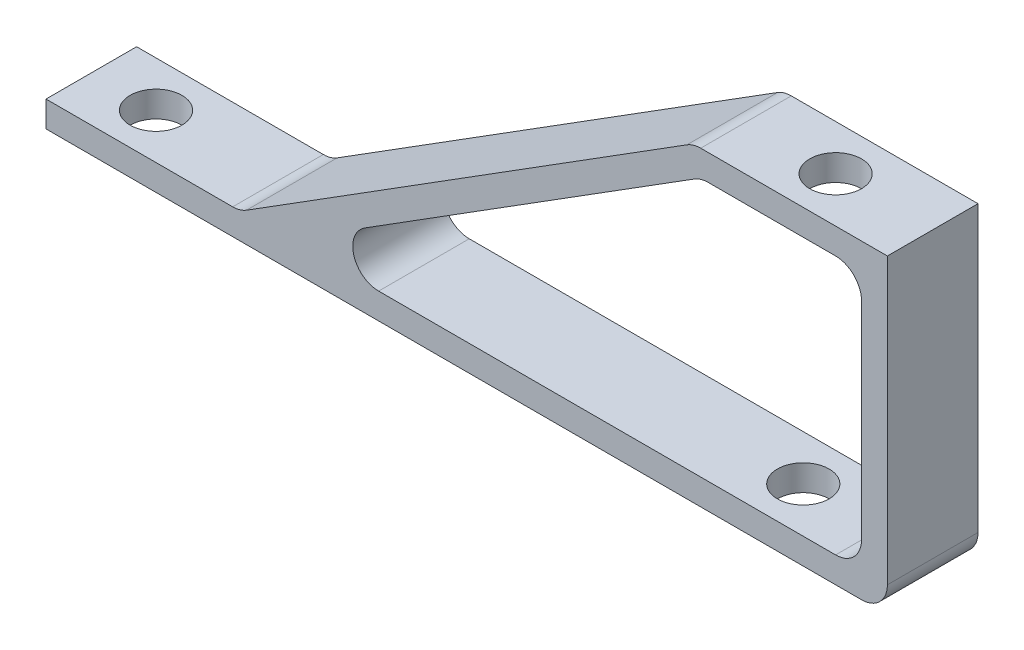
ISO-10303-21;
HEADER;
FILE_DESCRIPTION(('STEP AP214'),'2;1');
FILE_NAME('part.step','',(''),(''),'','','');
FILE_SCHEMA(('AUTOMOTIVE_DESIGN { 1 0 10303 214 1 1 1 1 }'));
ENDSEC;
DATA;
#1=APPLICATION_CONTEXT('core data for automotive mechanical design processes');
#2=APPLICATION_PROTOCOL_DEFINITION('international standard','automotive_design',2000,#1);
#3=PRODUCT_CONTEXT('',#1,'mechanical');
#4=PRODUCT('Part','Part','',(#3));
#5=PRODUCT_RELATED_PRODUCT_CATEGORY('part','',(#4));
#6=PRODUCT_DEFINITION_FORMATION('','',#4);
#7=PRODUCT_DEFINITION_CONTEXT('part definition',#1,'design');
#8=PRODUCT_DEFINITION('design','',#6,#7);
#9=PRODUCT_DEFINITION_SHAPE('','',#8);
#10=(LENGTH_UNIT() NAMED_UNIT(*) SI_UNIT(.MILLI.,.METRE.));
#11=(NAMED_UNIT(*) PLANE_ANGLE_UNIT() SI_UNIT($,.RADIAN.));
#12=(NAMED_UNIT(*) SI_UNIT($,.STERADIAN.) SOLID_ANGLE_UNIT());
#13=UNCERTAINTY_MEASURE_WITH_UNIT(LENGTH_MEASURE(1.E-05),#10,'distance_accuracy_value','');
#14=(GEOMETRIC_REPRESENTATION_CONTEXT(3) GLOBAL_UNCERTAINTY_ASSIGNED_CONTEXT((#13)) GLOBAL_UNIT_ASSIGNED_CONTEXT((#10,
#11,#12)) REPRESENTATION_CONTEXT('',''));
#15=CARTESIAN_POINT('',(0.,0.,0.));
#16=DIRECTION('',(0.,0.,1.));
#17=DIRECTION('',(1.,0.,0.));
#18=AXIS2_PLACEMENT_3D('',#15,#16,#17);
#19=CARTESIAN_POINT('',(0.,2.54,0.));
#20=DIRECTION('',(0.,-1.,0.));
#21=DIRECTION('',(0.,0.,-1.));
#22=AXIS2_PLACEMENT_3D('',#19,#20,#21);
#23=PLANE('',#22);
#24=CARTESIAN_POINT('',(-73.66,2.54,4.445));
#25=DIRECTION('',(0.,1.,0.));
#26=DIRECTION('',(0.,0.,1.));
#27=AXIS2_PLACEMENT_3D('',#24,#25,#26);
#28=CIRCLE('',#27,2.54);
#29=CARTESIAN_POINT('',(-73.66,2.54,6.985));
#30=VERTEX_POINT('',#29);
#31=EDGE_CURVE('E199',#30,#30,#28,.T.);
#32=ORIENTED_EDGE('',*,*,#31,.F.);
#33=EDGE_LOOP('',(#32));
#34=FACE_BOUND('',#33,.T.);
#35=DIRECTION('',(1.,0.,0.));
#36=VECTOR('',#35,1.);
#37=CARTESIAN_POINT('',(0.,2.54,8.89));
#38=LINE('',#37,#36);
#39=CARTESIAN_POINT('',(-80.01,2.54,8.88999999999999));
#40=VERTEX_POINT('',#39);
#41=CARTESIAN_POINT('',(-61.6919879623482,2.54,8.88999999999999));
#42=VERTEX_POINT('',#41);
#43=EDGE_CURVE('E212',#40,#42,#38,.T.);
#44=ORIENTED_EDGE('',*,*,#43,.T.);
#45=DIRECTION('',(0.,0.,1.));
#46=VECTOR('',#45,1.);
#47=CARTESIAN_POINT('',(-61.6919879623482,2.54,0.));
#48=LINE('',#47,#46);
#49=CARTESIAN_POINT('',(-61.6919879623482,2.54,0.));
#50=VERTEX_POINT('',#49);
#51=EDGE_CURVE('E262',#42,#50,#48,.F.);
#52=ORIENTED_EDGE('',*,*,#51,.T.);
#53=DIRECTION('',(-1.,0.,0.));
#54=VECTOR('',#53,1.);
#55=CARTESIAN_POINT('',(0.,2.54,0.));
#56=LINE('',#55,#54);
#57=CARTESIAN_POINT('',(-80.01,2.54,0.));
#58=VERTEX_POINT('',#57);
#59=EDGE_CURVE('E205',#50,#58,#56,.T.);
#60=ORIENTED_EDGE('',*,*,#59,.T.);
#61=DIRECTION('',(0.,0.,1.));
#62=VECTOR('',#61,1.);
#63=CARTESIAN_POINT('',(-80.01,2.54,0.));
#64=LINE('',#63,#62);
#65=EDGE_CURVE('E209',#58,#40,#64,.T.);
#66=ORIENTED_EDGE('',*,*,#65,.T.);
#67=EDGE_LOOP('',(#44,#52,#60,#66));
#68=FACE_BOUND('',#67,.T.);
#69=ADVANCED_FACE('F36',(#34,#68),#23,.F.);
#70=CARTESIAN_POINT('',(-2.54,2.54,0.));
#71=VERTEX_POINT('',#70);
#72=CARTESIAN_POINT('',(-47.3732968025764,2.54,0.));
#73=VERTEX_POINT('',#72);
#74=EDGE_CURVE('E207',#71,#73,#56,.T.);
#75=ORIENTED_EDGE('',*,*,#74,.T.);
#76=DIRECTION('',(0.,0.,1.));
#77=VECTOR('',#76,1.);
#78=CARTESIAN_POINT('',(-47.3732968025764,2.54,0.));
#79=LINE('',#78,#77);
#80=CARTESIAN_POINT('',(-47.3732968025764,2.54,8.88999999999999));
#81=VERTEX_POINT('',#80);
#82=EDGE_CURVE('E239',#73,#81,#79,.T.);
#83=ORIENTED_EDGE('',*,*,#82,.T.);
#84=CARTESIAN_POINT('',(-2.54,2.54,8.89));
#85=VERTEX_POINT('',#84);
#86=EDGE_CURVE('E211',#81,#85,#38,.T.);
#87=ORIENTED_EDGE('',*,*,#86,.T.);
#88=DIRECTION('',(0.,0.,-1.));
#89=VECTOR('',#88,1.);
#90=CARTESIAN_POINT('',(-2.54,2.54,0.));
#91=LINE('',#90,#89);
#92=EDGE_CURVE('E236',#85,#71,#91,.T.);
#93=ORIENTED_EDGE('',*,*,#92,.T.);
#94=EDGE_LOOP('',(#75,#83,#87,#93));
#95=FACE_BOUND('',#94,.T.);
#96=CARTESIAN_POINT('',(-10.16,2.54,4.44499999999999));
#97=DIRECTION('',(0.,1.,0.));
#98=DIRECTION('',(0.,0.,-1.));
#99=AXIS2_PLACEMENT_3D('',#96,#97,#98);
#100=CIRCLE('',#99,2.54);
#101=CARTESIAN_POINT('',(-10.16,2.54,1.905));
#102=VERTEX_POINT('',#101);
#103=EDGE_CURVE('E193',#102,#102,#100,.T.);
#104=ORIENTED_EDGE('',*,*,#103,.F.);
#105=EDGE_LOOP('',(#104));
#106=FACE_BOUND('',#105,.T.);
#107=ADVANCED_FACE('F337',(#95,#106),#23,.F.);
#108=CARTESIAN_POINT('',(0.,0.,0.));
#109=DIRECTION('',(0.,-1.,0.));
#110=DIRECTION('',(0.,0.,-1.));
#111=AXIS2_PLACEMENT_3D('',#108,#109,#110);
#112=PLANE('',#111);
#113=CARTESIAN_POINT('',(-73.66,0.,4.445));
#114=DIRECTION('',(0.,1.,0.));
#115=DIRECTION('',(0.,0.,1.));
#116=AXIS2_PLACEMENT_3D('',#113,#114,#115);
#117=CIRCLE('',#116,2.54);
#118=CARTESIAN_POINT('',(-73.66,0.,6.985));
#119=VERTEX_POINT('',#118);
#120=EDGE_CURVE('E196',#119,#119,#117,.T.);
#121=ORIENTED_EDGE('',*,*,#120,.T.);
#122=EDGE_LOOP('',(#121));
#123=FACE_BOUND('',#122,.T.);
#124=DIRECTION('',(-1.,0.,0.));
#125=VECTOR('',#124,1.);
#126=CARTESIAN_POINT('',(0.,0.,0.));
#127=LINE('',#126,#125);
#128=CARTESIAN_POINT('',(0.,0.,0.));
#129=VERTEX_POINT('',#128);
#130=CARTESIAN_POINT('',(-80.01,0.,0.));
#131=VERTEX_POINT('',#130);
#132=EDGE_CURVE('E202',#129,#131,#127,.T.);
#133=ORIENTED_EDGE('',*,*,#132,.F.);
#134=DIRECTION('',(0.,0.,-1.));
#135=VECTOR('',#134,1.);
#136=CARTESIAN_POINT('',(0.,0.,8.89));
#137=LINE('',#136,#135);
#138=CARTESIAN_POINT('',(0.,0.,8.89));
#139=VERTEX_POINT('',#138);
#140=EDGE_CURVE('E230',#129,#139,#137,.F.);
#141=ORIENTED_EDGE('',*,*,#140,.T.);
#142=DIRECTION('',(1.,0.,0.));
#143=VECTOR('',#142,1.);
#144=CARTESIAN_POINT('',(0.,0.,8.89));
#145=LINE('',#144,#143);
#146=CARTESIAN_POINT('',(-80.01,0.,8.88999999999999));
#147=VERTEX_POINT('',#146);
#148=EDGE_CURVE('E208',#147,#139,#145,.T.);
#149=ORIENTED_EDGE('',*,*,#148,.F.);
#150=DIRECTION('',(0.,0.,1.));
#151=VECTOR('',#150,1.);
#152=CARTESIAN_POINT('',(-80.01,0.,0.));
#153=LINE('',#152,#151);
#154=EDGE_CURVE('E217',#131,#147,#153,.T.);
#155=ORIENTED_EDGE('',*,*,#154,.F.);
#156=EDGE_LOOP('',(#133,#141,#149,#155));
#157=FACE_BOUND('',#156,.T.);
#158=CARTESIAN_POINT('',(-10.16,0.,4.44499999999999));
#159=DIRECTION('',(0.,1.,0.));
#160=DIRECTION('',(0.,0.,-1.));
#161=AXIS2_PLACEMENT_3D('',#158,#159,#160);
#162=CIRCLE('',#161,2.54);
#163=CARTESIAN_POINT('',(-10.16,0.,1.905));
#164=VERTEX_POINT('',#163);
#165=EDGE_CURVE('E176',#164,#164,#162,.T.);
#166=ORIENTED_EDGE('',*,*,#165,.T.);
#167=EDGE_LOOP('',(#166));
#168=FACE_BOUND('',#167,.T.);
#169=ADVANCED_FACE('F321',(#123,#157,#168),#112,.T.);
#170=CARTESIAN_POINT('',(0.,2.54,0.));
#171=DIRECTION('',(0.,0.,1.));
#172=DIRECTION('',(1.,0.,0.));
#173=AXIS2_PLACEMENT_3D('',#170,#171,#172);
#174=PLANE('',#173);
#175=DIRECTION('',(-1.,0.,0.));
#176=VECTOR('',#175,1.);
#177=CARTESIAN_POINT('',(2.54,27.94,0.));
#178=LINE('',#177,#176);
#179=CARTESIAN_POINT('',(-2.54,27.94,0.));
#180=VERTEX_POINT('',#179);
#181=CARTESIAN_POINT('',(-15.0460240753037,27.94,0.));
#182=VERTEX_POINT('',#181);
#183=EDGE_CURVE('E308',#180,#182,#178,.T.);
#184=ORIENTED_EDGE('',*,*,#183,.T.);
#185=CARTESIAN_POINT('',(-15.0460240753037,25.4,0.));
#186=DIRECTION('',(0.,0.,1.));
#187=DIRECTION('',(1.,0.,0.));
#188=AXIS2_PLACEMENT_3D('',#185,#186,#187);
#189=CIRCLE('',#188,2.54);
#190=CARTESIAN_POINT('',(-16.3977398001583,27.5504568349959,0.));
#191=VERTEX_POINT('',#190);
#192=EDGE_CURVE('E277',#182,#191,#189,.T.);
#193=ORIENTED_EDGE('',*,*,#192,.T.);
#194=DIRECTION('',(-0.846636549211005,-0.532171545218346,0.));
#195=VECTOR('',#194,1.);
#196=CARTESIAN_POINT('',(-15.1582842751454,28.329543165004,0.));
#197=LINE('',#196,#195);
#198=CARTESIAN_POINT('',(-48.725012527431,7.23045683499596,0.));
#199=VERTEX_POINT('',#198);
#200=EDGE_CURVE('E299',#191,#199,#197,.T.);
#201=ORIENTED_EDGE('',*,*,#200,.T.);
#202=CARTESIAN_POINT('',(-47.3732968025764,5.08,0.));
#203=DIRECTION('',(0.,0.,1.));
#204=DIRECTION('',(1.,0.,0.));
#205=AXIS2_PLACEMENT_3D('',#202,#203,#204);
#206=CIRCLE('',#205,2.54);
#207=EDGE_CURVE('E266',#199,#73,#206,.T.);
#208=ORIENTED_EDGE('',*,*,#207,.T.);
#209=ORIENTED_EDGE('',*,*,#74,.F.);
#210=CARTESIAN_POINT('',(-2.54,5.08,0.));
#211=DIRECTION('',(0.,0.,1.));
#212=DIRECTION('',(1.,0.,0.));
#213=AXIS2_PLACEMENT_3D('',#210,#211,#212);
#214=CIRCLE('',#213,2.54);
#215=CARTESIAN_POINT('',(0.,5.08,0.));
#216=VERTEX_POINT('',#215);
#217=EDGE_CURVE('E268',#71,#216,#214,.T.);
#218=ORIENTED_EDGE('',*,*,#217,.T.);
#219=DIRECTION('',(0.,1.,0.));
#220=VECTOR('',#219,1.);
#221=CARTESIAN_POINT('',(0.,0.,0.));
#222=LINE('',#221,#220);
#223=CARTESIAN_POINT('',(0.,25.4,0.));
#224=VERTEX_POINT('',#223);
#225=EDGE_CURVE('E189',#216,#224,#222,.T.);
#226=ORIENTED_EDGE('',*,*,#225,.T.);
#227=CARTESIAN_POINT('',(-2.54,25.4,0.));
#228=DIRECTION('',(0.,0.,1.));
#229=DIRECTION('',(1.,0.,0.));
#230=AXIS2_PLACEMENT_3D('',#227,#228,#229);
#231=CIRCLE('',#230,2.54);
#232=EDGE_CURVE('E273',#224,#180,#231,.T.);
#233=ORIENTED_EDGE('',*,*,#232,.T.);
#234=EDGE_LOOP('',(#184,#193,#201,#208,#209,#218,#226,#233));
#235=FACE_BOUND('',#234,.T.);
#236=DIRECTION('',(0.,1.,0.));
#237=VECTOR('',#236,1.);
#238=CARTESIAN_POINT('',(2.54,0.,0.));
#239=LINE('',#238,#237);
#240=CARTESIAN_POINT('',(2.54,2.54,0.));
#241=VERTEX_POINT('',#240);
#242=CARTESIAN_POINT('',(2.54,30.48,0.));
#243=VERTEX_POINT('',#242);
#244=EDGE_CURVE('E155',#241,#243,#239,.T.);
#245=ORIENTED_EDGE('',*,*,#244,.F.);
#246=CARTESIAN_POINT('',(0.,2.54,0.));
#247=DIRECTION('',(0.,0.,1.));
#248=DIRECTION('',(1.,0.,0.));
#249=AXIS2_PLACEMENT_3D('',#246,#247,#248);
#250=CIRCLE('',#249,2.54);
#251=EDGE_CURVE('E228',#241,#129,#250,.F.);
#252=ORIENTED_EDGE('',*,*,#251,.T.);
#253=ORIENTED_EDGE('',*,*,#132,.T.);
#254=DIRECTION('',(0.,-1.,0.));
#255=VECTOR('',#254,1.);
#256=CARTESIAN_POINT('',(-80.01,2.54,0.));
#257=LINE('',#256,#255);
#258=EDGE_CURVE('E223',#58,#131,#257,.T.);
#259=ORIENTED_EDGE('',*,*,#258,.F.);
#260=ORIENTED_EDGE('',*,*,#59,.F.);
#261=CARTESIAN_POINT('',(-61.6919879623482,5.08,0.));
#262=DIRECTION('',(0.,0.,1.));
#263=DIRECTION('',(1.,0.,0.));
#264=AXIS2_PLACEMENT_3D('',#261,#262,#263);
#265=CIRCLE('',#264,2.54);
#266=CARTESIAN_POINT('',(-60.3402722374936,2.92954316500405,0.));
#267=VERTEX_POINT('',#266);
#268=EDGE_CURVE('E11',#50,#267,#265,.T.);
#269=ORIENTED_EDGE('',*,*,#268,.T.);
#270=DIRECTION('',(-0.846636549211005,-0.532171545218346,0.));
#271=VECTOR('',#270,1.);
#272=CARTESIAN_POINT('',(-16.51,30.48,0.));
#273=LINE('',#272,#271);
#274=CARTESIAN_POINT('',(-17.1297277625064,30.0904568349959,0.));
#275=VERTEX_POINT('',#274);
#276=EDGE_CURVE('E293',#275,#267,#273,.T.);
#277=ORIENTED_EDGE('',*,*,#276,.F.);
#278=CARTESIAN_POINT('',(-15.7780120376518,27.94,0.));
#279=DIRECTION('',(0.,0.,1.));
#280=DIRECTION('',(1.,0.,0.));
#281=AXIS2_PLACEMENT_3D('',#278,#279,#280);
#282=CIRCLE('',#281,2.54);
#283=CARTESIAN_POINT('',(-15.7780120376518,30.48,0.));
#284=VERTEX_POINT('',#283);
#285=EDGE_CURVE('E172',#275,#284,#282,.F.);
#286=ORIENTED_EDGE('',*,*,#285,.T.);
#287=DIRECTION('',(-1.,0.,0.));
#288=VECTOR('',#287,1.);
#289=CARTESIAN_POINT('',(2.54,30.48,0.));
#290=LINE('',#289,#288);
#291=EDGE_CURVE('E168',#243,#284,#290,.T.);
#292=ORIENTED_EDGE('',*,*,#291,.F.);
#293=EDGE_LOOP('',(#245,#252,#253,#259,#260,#269,#277,#286,#292));
#294=FACE_BOUND('',#293,.T.);
#295=ADVANCED_FACE('F169',(#235,#294),#174,.F.);
#296=CARTESIAN_POINT('',(-80.01,2.54,0.));
#297=DIRECTION('',(1.,0.,0.));
#298=DIRECTION('',(0.,0.,-1.));
#299=AXIS2_PLACEMENT_3D('',#296,#297,#298);
#300=PLANE('',#299);
#301=ORIENTED_EDGE('',*,*,#154,.T.);
#302=DIRECTION('',(0.,-1.,0.));
#303=VECTOR('',#302,1.);
#304=CARTESIAN_POINT('',(-80.01,2.54,8.88999999999999));
#305=LINE('',#304,#303);
#306=EDGE_CURVE('E215',#40,#147,#305,.T.);
#307=ORIENTED_EDGE('',*,*,#306,.F.);
#308=ORIENTED_EDGE('',*,*,#65,.F.);
#309=ORIENTED_EDGE('',*,*,#258,.T.);
#310=EDGE_LOOP('',(#301,#307,#308,#309));
#311=FACE_BOUND('',#310,.T.);
#312=ADVANCED_FACE('F325',(#311),#300,.F.);
#313=CARTESIAN_POINT('',(0.,2.54,8.89));
#314=DIRECTION('',(0.,0.,-1.));
#315=DIRECTION('',(-1.,0.,0.));
#316=AXIS2_PLACEMENT_3D('',#313,#314,#315);
#317=PLANE('',#316);
#318=ORIENTED_EDGE('',*,*,#148,.T.);
#319=CARTESIAN_POINT('',(0.,2.54,8.89));
#320=DIRECTION('',(0.,0.,-1.));
#321=DIRECTION('',(-1.,0.,0.));
#322=AXIS2_PLACEMENT_3D('',#319,#320,#321);
#323=CIRCLE('',#322,2.54);
#324=CARTESIAN_POINT('',(2.54,2.54,8.89));
#325=VERTEX_POINT('',#324);
#326=EDGE_CURVE('E234',#139,#325,#323,.F.);
#327=ORIENTED_EDGE('',*,*,#326,.T.);
#328=DIRECTION('',(0.,-1.,0.));
#329=VECTOR('',#328,1.);
#330=CARTESIAN_POINT('',(2.54,0.,8.89));
#331=LINE('',#330,#329);
#332=CARTESIAN_POINT('',(2.54,30.48,8.89));
#333=VERTEX_POINT('',#332);
#334=EDGE_CURVE('E165',#333,#325,#331,.T.);
#335=ORIENTED_EDGE('',*,*,#334,.F.);
#336=DIRECTION('',(-1.,0.,0.));
#337=VECTOR('',#336,1.);
#338=CARTESIAN_POINT('',(2.54,30.48,8.89));
#339=LINE('',#338,#337);
#340=CARTESIAN_POINT('',(-15.7780120376518,30.48,8.89));
#341=VERTEX_POINT('',#340);
#342=EDGE_CURVE('E177',#333,#341,#339,.T.);
#343=ORIENTED_EDGE('',*,*,#342,.T.);
#344=CARTESIAN_POINT('',(-15.7780120376518,27.94,8.89));
#345=DIRECTION('',(0.,0.,-1.));
#346=DIRECTION('',(-1.,0.,0.));
#347=AXIS2_PLACEMENT_3D('',#344,#345,#346);
#348=CIRCLE('',#347,2.54);
#349=CARTESIAN_POINT('',(-17.1297277625064,30.0904568349959,8.89));
#350=VERTEX_POINT('',#349);
#351=EDGE_CURVE('E232',#341,#350,#348,.F.);
#352=ORIENTED_EDGE('',*,*,#351,.T.);
#353=DIRECTION('',(0.846636549211005,0.532171545218346,0.));
#354=VECTOR('',#353,1.);
#355=CARTESIAN_POINT('',(-16.51,30.48,8.89));
#356=LINE('',#355,#354);
#357=CARTESIAN_POINT('',(-60.3402722374936,2.92954316500405,8.88999999999999));
#358=VERTEX_POINT('',#357);
#359=EDGE_CURVE('E283',#358,#350,#356,.T.);
#360=ORIENTED_EDGE('',*,*,#359,.F.);
#361=CARTESIAN_POINT('',(-61.6919879623482,5.08,8.88999999999999));
#362=DIRECTION('',(0.,0.,-1.));
#363=DIRECTION('',(-1.,0.,0.));
#364=AXIS2_PLACEMENT_3D('',#361,#362,#363);
#365=CIRCLE('',#364,2.54);
#366=EDGE_CURVE('E44',#358,#42,#365,.T.);
#367=ORIENTED_EDGE('',*,*,#366,.T.);
#368=ORIENTED_EDGE('',*,*,#43,.F.);
#369=ORIENTED_EDGE('',*,*,#306,.T.);
#370=EDGE_LOOP('',(#318,#327,#335,#343,#352,#360,#367,#368,#369));
#371=FACE_BOUND('',#370,.T.);
#372=ORIENTED_EDGE('',*,*,#86,.F.);
#373=CARTESIAN_POINT('',(-47.3732968025764,5.08,8.88999999999999));
#374=DIRECTION('',(0.,0.,-1.));
#375=DIRECTION('',(-1.,0.,0.));
#376=AXIS2_PLACEMENT_3D('',#373,#374,#375);
#377=CIRCLE('',#376,2.54);
#378=CARTESIAN_POINT('',(-48.725012527431,7.23045683499596,8.88999999999999));
#379=VERTEX_POINT('',#378);
#380=EDGE_CURVE('E264',#81,#379,#377,.T.);
#381=ORIENTED_EDGE('',*,*,#380,.T.);
#382=DIRECTION('',(0.846636549211005,0.532171545218346,0.));
#383=VECTOR('',#382,1.);
#384=CARTESIAN_POINT('',(-15.1582842751454,28.329543165004,8.89));
#385=LINE('',#384,#383);
#386=CARTESIAN_POINT('',(-16.3977398001583,27.5504568349959,8.89));
#387=VERTEX_POINT('',#386);
#388=EDGE_CURVE('E302',#379,#387,#385,.T.);
#389=ORIENTED_EDGE('',*,*,#388,.T.);
#390=CARTESIAN_POINT('',(-15.0460240753037,25.4,8.89));
#391=DIRECTION('',(0.,0.,-1.));
#392=DIRECTION('',(-1.,0.,0.));
#393=AXIS2_PLACEMENT_3D('',#390,#391,#392);
#394=CIRCLE('',#393,2.54);
#395=CARTESIAN_POINT('',(-15.0460240753037,27.94,8.88999999999999));
#396=VERTEX_POINT('',#395);
#397=EDGE_CURVE('E275',#387,#396,#394,.T.);
#398=ORIENTED_EDGE('',*,*,#397,.T.);
#399=DIRECTION('',(1.,0.,0.));
#400=VECTOR('',#399,1.);
#401=CARTESIAN_POINT('',(2.54,27.94,8.89));
#402=LINE('',#401,#400);
#403=CARTESIAN_POINT('',(-2.54,27.94,8.89));
#404=VERTEX_POINT('',#403);
#405=EDGE_CURVE('E190',#396,#404,#402,.T.);
#406=ORIENTED_EDGE('',*,*,#405,.T.);
#407=CARTESIAN_POINT('',(-2.54,25.4,8.89));
#408=DIRECTION('',(0.,0.,-1.));
#409=DIRECTION('',(-1.,0.,0.));
#410=AXIS2_PLACEMENT_3D('',#407,#408,#409);
#411=CIRCLE('',#410,2.54);
#412=CARTESIAN_POINT('',(0.,25.4,8.89));
#413=VERTEX_POINT('',#412);
#414=EDGE_CURVE('E58',#404,#413,#411,.T.);
#415=ORIENTED_EDGE('',*,*,#414,.T.);
#416=DIRECTION('',(0.,-1.,0.));
#417=VECTOR('',#416,1.);
#418=CARTESIAN_POINT('',(0.,0.,8.89));
#419=LINE('',#418,#417);
#420=CARTESIAN_POINT('',(0.,5.08,8.89));
#421=VERTEX_POINT('',#420);
#422=EDGE_CURVE('E187',#413,#421,#419,.T.);
#423=ORIENTED_EDGE('',*,*,#422,.T.);
#424=CARTESIAN_POINT('',(-2.54,5.08,8.89));
#425=DIRECTION('',(0.,0.,-1.));
#426=DIRECTION('',(-1.,0.,0.));
#427=AXIS2_PLACEMENT_3D('',#424,#425,#426);
#428=CIRCLE('',#427,2.54);
#429=EDGE_CURVE('E270',#421,#85,#428,.T.);
#430=ORIENTED_EDGE('',*,*,#429,.T.);
#431=EDGE_LOOP('',(#372,#381,#389,#398,#406,#415,#423,#430));
#432=FACE_BOUND('',#431,.T.);
#433=ADVANCED_FACE('F281',(#371,#432),#317,.F.);
#434=CARTESIAN_POINT('',(-73.66,2.54,4.445));
#435=DIRECTION('',(0.,-1.,0.));
#436=DIRECTION('',(0.,0.,-1.));
#437=AXIS2_PLACEMENT_3D('',#434,#435,#436);
#438=CYLINDRICAL_SURFACE('',#437,2.54);
#439=ORIENTED_EDGE('',*,*,#31,.T.);
#440=EDGE_LOOP('',(#439));
#441=FACE_BOUND('',#440,.T.);
#442=ORIENTED_EDGE('',*,*,#120,.F.);
#443=EDGE_LOOP('',(#442));
#444=FACE_BOUND('',#443,.T.);
#445=ADVANCED_FACE('F332',(#441,#444),#438,.F.);
#446=CARTESIAN_POINT('',(-10.16,2.54,4.44499999999999));
#447=DIRECTION('',(0.,-1.,0.));
#448=DIRECTION('',(0.,0.,-1.));
#449=AXIS2_PLACEMENT_3D('',#446,#447,#448);
#450=CYLINDRICAL_SURFACE('',#449,2.54);
#451=ORIENTED_EDGE('',*,*,#103,.T.);
#452=EDGE_LOOP('',(#451));
#453=FACE_BOUND('',#452,.T.);
#454=ORIENTED_EDGE('',*,*,#165,.F.);
#455=EDGE_LOOP('',(#454));
#456=FACE_BOUND('',#455,.T.);
#457=ADVANCED_FACE('F355',(#453,#456),#450,.F.);
#458=CARTESIAN_POINT('',(0.,0.,0.));
#459=DIRECTION('',(-1.,0.,0.));
#460=DIRECTION('',(0.,0.,1.));
#461=AXIS2_PLACEMENT_3D('',#458,#459,#460);
#462=PLANE('',#461);
#463=ORIENTED_EDGE('',*,*,#225,.F.);
#464=DIRECTION('',(0.,0.,-1.));
#465=VECTOR('',#464,1.);
#466=CARTESIAN_POINT('',(0.,5.08,0.));
#467=LINE('',#466,#465);
#468=EDGE_CURVE('E51',#216,#421,#467,.F.);
#469=ORIENTED_EDGE('',*,*,#468,.T.);
#470=ORIENTED_EDGE('',*,*,#422,.F.);
#471=DIRECTION('',(0.,0.,1.));
#472=VECTOR('',#471,1.);
#473=CARTESIAN_POINT('',(0.,25.4,0.));
#474=LINE('',#473,#472);
#475=EDGE_CURVE('E247',#413,#224,#474,.F.);
#476=ORIENTED_EDGE('',*,*,#475,.T.);
#477=EDGE_LOOP('',(#463,#469,#470,#476));
#478=FACE_BOUND('',#477,.T.);
#479=ADVANCED_FACE('F360',(#478),#462,.T.);
#480=CARTESIAN_POINT('',(2.54,30.48,8.89));
#481=DIRECTION('',(0.,-1.,0.));
#482=DIRECTION('',(0.,0.,-1.));
#483=AXIS2_PLACEMENT_3D('',#480,#481,#482);
#484=PLANE('',#483);
#485=ORIENTED_EDGE('',*,*,#291,.T.);
#486=DIRECTION('',(0.,0.,1.));
#487=VECTOR('',#486,1.);
#488=CARTESIAN_POINT('',(-15.7780120376518,30.48,8.89));
#489=LINE('',#488,#487);
#490=EDGE_CURVE('E255',#284,#341,#489,.T.);
#491=ORIENTED_EDGE('',*,*,#490,.T.);
#492=ORIENTED_EDGE('',*,*,#342,.F.);
#493=DIRECTION('',(0.,0.,1.));
#494=VECTOR('',#493,1.);
#495=CARTESIAN_POINT('',(2.54,30.48,8.89));
#496=LINE('',#495,#494);
#497=EDGE_CURVE('E160',#243,#333,#496,.T.);
#498=ORIENTED_EDGE('',*,*,#497,.F.);
#499=EDGE_LOOP('',(#485,#491,#492,#498));
#500=FACE_BOUND('',#499,.T.);
#501=CARTESIAN_POINT('',(-6.985,30.48,4.445));
#502=DIRECTION('',(0.,1.,0.));
#503=DIRECTION('',(0.,0.,1.));
#504=AXIS2_PLACEMENT_3D('',#501,#502,#503);
#505=CIRCLE('',#504,2.54);
#506=CARTESIAN_POINT('',(-6.985,30.48,6.985));
#507=VERTEX_POINT('',#506);
#508=EDGE_CURVE('E309',#507,#507,#505,.T.);
#509=ORIENTED_EDGE('',*,*,#508,.F.);
#510=EDGE_LOOP('',(#509));
#511=FACE_BOUND('',#510,.T.);
#512=ADVANCED_FACE('F179',(#500,#511),#484,.F.);
#513=CARTESIAN_POINT('',(2.54,0.,0.));
#514=DIRECTION('',(-1.,0.,0.));
#515=DIRECTION('',(0.,0.,1.));
#516=AXIS2_PLACEMENT_3D('',#513,#514,#515);
#517=PLANE('',#516);
#518=ORIENTED_EDGE('',*,*,#334,.T.);
#519=DIRECTION('',(0.,0.,-1.));
#520=VECTOR('',#519,1.);
#521=CARTESIAN_POINT('',(2.54,2.54,0.));
#522=LINE('',#521,#520);
#523=EDGE_CURVE('E163',#325,#241,#522,.T.);
#524=ORIENTED_EDGE('',*,*,#523,.T.);
#525=ORIENTED_EDGE('',*,*,#244,.T.);
#526=ORIENTED_EDGE('',*,*,#497,.T.);
#527=EDGE_LOOP('',(#518,#524,#525,#526));
#528=FACE_BOUND('',#527,.T.);
#529=ADVANCED_FACE('F158',(#528),#517,.F.);
#530=CARTESIAN_POINT('',(0.,27.94,0.));
#531=DIRECTION('',(0.,-1.,0.));
#532=DIRECTION('',(0.,0.,-1.));
#533=AXIS2_PLACEMENT_3D('',#530,#531,#532);
#534=PLANE('',#533);
#535=ORIENTED_EDGE('',*,*,#183,.F.);
#536=DIRECTION('',(0.,0.,1.));
#537=VECTOR('',#536,1.);
#538=CARTESIAN_POINT('',(-2.54,27.94,8.89));
#539=LINE('',#538,#537);
#540=EDGE_CURVE('E252',#180,#404,#539,.T.);
#541=ORIENTED_EDGE('',*,*,#540,.T.);
#542=ORIENTED_EDGE('',*,*,#405,.F.);
#543=DIRECTION('',(0.,0.,1.));
#544=VECTOR('',#543,1.);
#545=CARTESIAN_POINT('',(-15.0460240753037,27.94,0.));
#546=LINE('',#545,#544);
#547=EDGE_CURVE('E250',#396,#182,#546,.F.);
#548=ORIENTED_EDGE('',*,*,#547,.T.);
#549=EDGE_LOOP('',(#535,#541,#542,#548));
#550=FACE_BOUND('',#549,.T.);
#551=CARTESIAN_POINT('',(-6.985,27.94,4.445));
#552=DIRECTION('',(0.,1.,0.));
#553=DIRECTION('',(0.,0.,1.));
#554=AXIS2_PLACEMENT_3D('',#551,#552,#553);
#555=CIRCLE('',#554,2.54);
#556=CARTESIAN_POINT('',(-6.985,27.94,6.985));
#557=VERTEX_POINT('',#556);
#558=EDGE_CURVE('E305',#557,#557,#555,.T.);
#559=ORIENTED_EDGE('',*,*,#558,.T.);
#560=EDGE_LOOP('',(#559));
#561=FACE_BOUND('',#560,.T.);
#562=ADVANCED_FACE('F372',(#550,#561),#534,.T.);
#563=CARTESIAN_POINT('',(-6.985,27.94,4.445));
#564=DIRECTION('',(0.,1.,0.));
#565=DIRECTION('',(0.,0.,1.));
#566=AXIS2_PLACEMENT_3D('',#563,#564,#565);
#567=CYLINDRICAL_SURFACE('',#566,2.54);
#568=ORIENTED_EDGE('',*,*,#558,.F.);
#569=EDGE_LOOP('',(#568));
#570=FACE_BOUND('',#569,.T.);
#571=ORIENTED_EDGE('',*,*,#508,.T.);
#572=EDGE_LOOP('',(#571));
#573=FACE_BOUND('',#572,.T.);
#574=ADVANCED_FACE('F375',(#570,#573),#567,.F.);
#575=CARTESIAN_POINT('',(-17.0569677157539,27.1360850023358,0.));
#576=DIRECTION('',(0.532171545218346,-0.846636549211005,0.));
#577=DIRECTION('',(0.846636549211005,0.532171545218346,0.));
#578=AXIS2_PLACEMENT_3D('',#575,#576,#577);
#579=PLANE('',#578);
#580=ORIENTED_EDGE('',*,*,#388,.F.);
#581=DIRECTION('',(0.,0.,1.));
#582=VECTOR('',#581,1.);
#583=CARTESIAN_POINT('',(-48.725012527431,7.23045683499596,0.));
#584=LINE('',#583,#582);
#585=EDGE_CURVE('E245',#379,#199,#584,.F.);
#586=ORIENTED_EDGE('',*,*,#585,.T.);
#587=ORIENTED_EDGE('',*,*,#200,.F.);
#588=DIRECTION('',(0.,0.,1.));
#589=VECTOR('',#588,1.);
#590=CARTESIAN_POINT('',(-16.3977398001583,27.5504568349959,8.89));
#591=LINE('',#590,#589);
#592=EDGE_CURVE('E242',#191,#387,#591,.T.);
#593=ORIENTED_EDGE('',*,*,#592,.T.);
#594=EDGE_LOOP('',(#580,#586,#587,#593));
#595=FACE_BOUND('',#594,.T.);
#596=ADVANCED_FACE('F379',(#595),#579,.T.);
#597=CARTESIAN_POINT('',(-18.4086834406085,29.2865418373318,0.));
#598=DIRECTION('',(0.532171545218346,-0.846636549211005,0.));
#599=DIRECTION('',(0.846636549211005,0.532171545218346,0.));
#600=AXIS2_PLACEMENT_3D('',#597,#598,#599);
#601=PLANE('',#600);
#602=ORIENTED_EDGE('',*,*,#359,.T.);
#603=DIRECTION('',(0.,0.,1.));
#604=VECTOR('',#603,1.);
#605=CARTESIAN_POINT('',(-17.1297277625064,30.0904568349959,0.));
#606=LINE('',#605,#604);
#607=EDGE_CURVE('E260',#350,#275,#606,.F.);
#608=ORIENTED_EDGE('',*,*,#607,.T.);
#609=ORIENTED_EDGE('',*,*,#276,.T.);
#610=DIRECTION('',(0.,0.,1.));
#611=VECTOR('',#610,1.);
#612=CARTESIAN_POINT('',(-60.3402722374936,2.92954316500405,8.88999999999999));
#613=LINE('',#612,#611);
#614=EDGE_CURVE('E257',#267,#358,#613,.T.);
#615=ORIENTED_EDGE('',*,*,#614,.T.);
#616=EDGE_LOOP('',(#602,#608,#609,#615));
#617=FACE_BOUND('',#616,.T.);
#618=ADVANCED_FACE('F296',(#617),#601,.F.);
#619=CARTESIAN_POINT('',(0.,2.54,0.));
#620=DIRECTION('',(0.,0.,1.));
#621=DIRECTION('',(1.,0.,0.));
#622=AXIS2_PLACEMENT_3D('',#619,#620,#621);
#623=CYLINDRICAL_SURFACE('',#622,2.54);
#624=ORIENTED_EDGE('',*,*,#326,.F.);
#625=ORIENTED_EDGE('',*,*,#140,.F.);
#626=ORIENTED_EDGE('',*,*,#251,.F.);
#627=ORIENTED_EDGE('',*,*,#523,.F.);
#628=EDGE_LOOP('',(#624,#625,#626,#627));
#629=FACE_BOUND('',#628,.T.);
#630=ADVANCED_FACE('F316',(#629),#623,.T.);
#631=CARTESIAN_POINT('',(-47.3732968025764,5.08,0.));
#632=DIRECTION('',(0.,0.,1.));
#633=DIRECTION('',(1.,0.,0.));
#634=AXIS2_PLACEMENT_3D('',#631,#632,#633);
#635=CYLINDRICAL_SURFACE('',#634,2.54);
#636=ORIENTED_EDGE('',*,*,#207,.F.);
#637=ORIENTED_EDGE('',*,*,#585,.F.);
#638=ORIENTED_EDGE('',*,*,#380,.F.);
#639=ORIENTED_EDGE('',*,*,#82,.F.);
#640=EDGE_LOOP('',(#636,#637,#638,#639));
#641=FACE_BOUND('',#640,.T.);
#642=ADVANCED_FACE('F395',(#641),#635,.F.);
#643=CARTESIAN_POINT('',(-2.54,5.08,0.));
#644=DIRECTION('',(0.,0.,-1.));
#645=DIRECTION('',(-1.,0.,0.));
#646=AXIS2_PLACEMENT_3D('',#643,#644,#645);
#647=CYLINDRICAL_SURFACE('',#646,2.54);
#648=ORIENTED_EDGE('',*,*,#429,.F.);
#649=ORIENTED_EDGE('',*,*,#468,.F.);
#650=ORIENTED_EDGE('',*,*,#217,.F.);
#651=ORIENTED_EDGE('',*,*,#92,.F.);
#652=EDGE_LOOP('',(#648,#649,#650,#651));
#653=FACE_BOUND('',#652,.T.);
#654=ADVANCED_FACE('F405',(#653),#647,.F.);
#655=CARTESIAN_POINT('',(-2.54,25.4,0.));
#656=DIRECTION('',(0.,0.,-1.));
#657=DIRECTION('',(-1.,0.,0.));
#658=AXIS2_PLACEMENT_3D('',#655,#656,#657);
#659=CYLINDRICAL_SURFACE('',#658,2.54);
#660=ORIENTED_EDGE('',*,*,#232,.F.);
#661=ORIENTED_EDGE('',*,*,#475,.F.);
#662=ORIENTED_EDGE('',*,*,#414,.F.);
#663=ORIENTED_EDGE('',*,*,#540,.F.);
#664=EDGE_LOOP('',(#660,#661,#662,#663));
#665=FACE_BOUND('',#664,.T.);
#666=ADVANCED_FACE('F409',(#665),#659,.F.);
#667=CARTESIAN_POINT('',(-15.0460240753037,25.4,0.));
#668=DIRECTION('',(0.,0.,-1.));
#669=DIRECTION('',(-1.,0.,0.));
#670=AXIS2_PLACEMENT_3D('',#667,#668,#669);
#671=CYLINDRICAL_SURFACE('',#670,2.54);
#672=ORIENTED_EDGE('',*,*,#192,.F.);
#673=ORIENTED_EDGE('',*,*,#547,.F.);
#674=ORIENTED_EDGE('',*,*,#397,.F.);
#675=ORIENTED_EDGE('',*,*,#592,.F.);
#676=EDGE_LOOP('',(#672,#673,#674,#675));
#677=FACE_BOUND('',#676,.T.);
#678=ADVANCED_FACE('F417',(#677),#671,.F.);
#679=CARTESIAN_POINT('',(-15.7780120376518,27.94,8.89));
#680=DIRECTION('',(0.,0.,1.));
#681=DIRECTION('',(1.,0.,0.));
#682=AXIS2_PLACEMENT_3D('',#679,#680,#681);
#683=CYLINDRICAL_SURFACE('',#682,2.54);
#684=ORIENTED_EDGE('',*,*,#285,.F.);
#685=ORIENTED_EDGE('',*,*,#607,.F.);
#686=ORIENTED_EDGE('',*,*,#351,.F.);
#687=ORIENTED_EDGE('',*,*,#490,.F.);
#688=EDGE_LOOP('',(#684,#685,#686,#687));
#689=FACE_BOUND('',#688,.T.);
#690=ADVANCED_FACE('F419',(#689),#683,.T.);
#691=CARTESIAN_POINT('',(-61.6919879623482,5.08,0.));
#692=DIRECTION('',(0.,0.,-1.));
#693=DIRECTION('',(-1.,0.,0.));
#694=AXIS2_PLACEMENT_3D('',#691,#692,#693);
#695=CYLINDRICAL_SURFACE('',#694,2.54);
#696=ORIENTED_EDGE('',*,*,#268,.F.);
#697=ORIENTED_EDGE('',*,*,#51,.F.);
#698=ORIENTED_EDGE('',*,*,#366,.F.);
#699=ORIENTED_EDGE('',*,*,#614,.F.);
#700=EDGE_LOOP('',(#696,#697,#698,#699));
#701=FACE_BOUND('',#700,.T.);
#702=ADVANCED_FACE('F38',(#701),#695,.F.);
#703=CLOSED_SHELL('',(#69,#107,#169,#295,#312,#433,#445,#457,#479,#512,#529,#562,#574,#596,#618,
#630,#642,#654,#666,#678,#690,#702));
#704=MANIFOLD_SOLID_BREP('B2',#703);
#705=ADVANCED_BREP_SHAPE_REPRESENTATION('',(#18,#704),#14);
#706=SHAPE_DEFINITION_REPRESENTATION(#9,#705);
ENDSEC;
END-ISO-10303-21;
